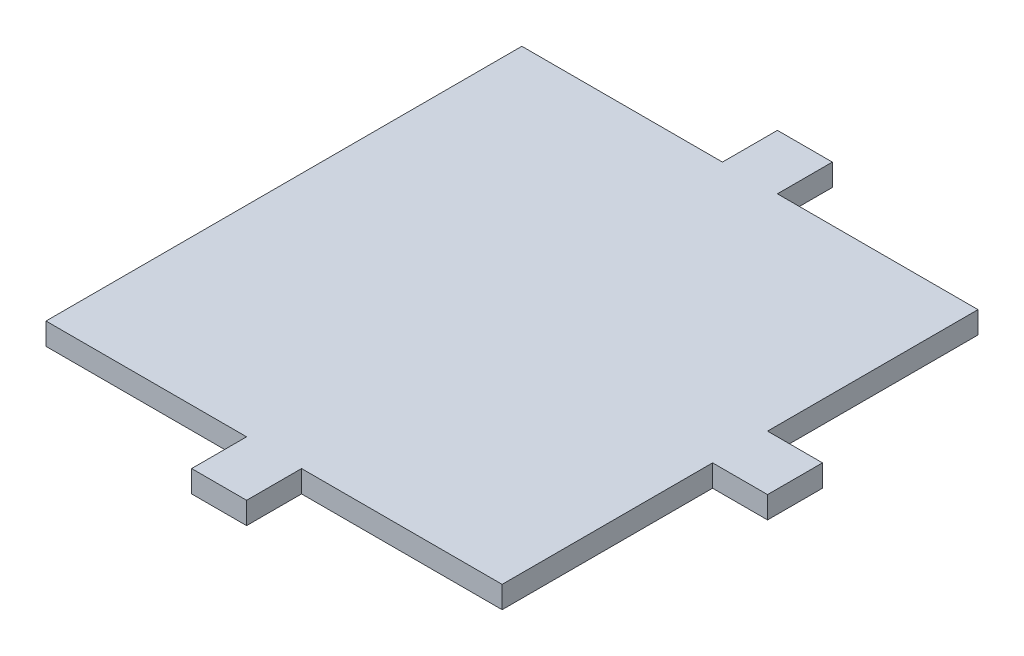
ISO-10303-21;
HEADER;
FILE_DESCRIPTION(('STEP AP214'),'2;1');
FILE_NAME('part.step','',(''),(''),'','','');
FILE_SCHEMA(('AUTOMOTIVE_DESIGN { 1 0 10303 214 1 1 1 1 }'));
ENDSEC;
DATA;
#1=APPLICATION_CONTEXT('core data for automotive mechanical design processes');
#2=APPLICATION_PROTOCOL_DEFINITION('international standard','automotive_design',2000,#1);
#3=PRODUCT_CONTEXT('',#1,'mechanical');
#4=PRODUCT('Part','Part','',(#3));
#5=PRODUCT_RELATED_PRODUCT_CATEGORY('part','',(#4));
#6=PRODUCT_DEFINITION_FORMATION('','',#4);
#7=PRODUCT_DEFINITION_CONTEXT('part definition',#1,'design');
#8=PRODUCT_DEFINITION('design','',#6,#7);
#9=PRODUCT_DEFINITION_SHAPE('','',#8);
#10=(LENGTH_UNIT() NAMED_UNIT(*) SI_UNIT(.MILLI.,.METRE.));
#11=(NAMED_UNIT(*) PLANE_ANGLE_UNIT() SI_UNIT($,.RADIAN.));
#12=(NAMED_UNIT(*) SI_UNIT($,.STERADIAN.) SOLID_ANGLE_UNIT());
#13=UNCERTAINTY_MEASURE_WITH_UNIT(LENGTH_MEASURE(1.E-05),#10,'distance_accuracy_value','');
#14=(GEOMETRIC_REPRESENTATION_CONTEXT(3) GLOBAL_UNCERTAINTY_ASSIGNED_CONTEXT((#13)) GLOBAL_UNIT_ASSIGNED_CONTEXT((#10,
#11,#12)) REPRESENTATION_CONTEXT('',''));
#15=CARTESIAN_POINT('',(0.,0.,0.));
#16=DIRECTION('',(0.,0.,1.));
#17=DIRECTION('',(1.,0.,0.));
#18=AXIS2_PLACEMENT_3D('',#15,#16,#17);
#19=CARTESIAN_POINT('',(3.49999999999998,3.,3.49999999999999));
#20=DIRECTION('',(-1.,0.,0.));
#21=DIRECTION('',(0.,0.,1.));
#22=AXIS2_PLACEMENT_3D('',#19,#20,#21);
#23=PLANE('',#22);
#24=DIRECTION('',(0.,0.,-1.));
#25=VECTOR('',#24,1.);
#26=CARTESIAN_POINT('',(3.49999999999998,0.,3.49999999999999));
#27=LINE('',#26,#25);
#28=CARTESIAN_POINT('',(3.49999999999998,0.,3.49999999999999));
#29=VERTEX_POINT('',#28);
#30=CARTESIAN_POINT('',(3.49999999999998,0.,-3.50000000000001));
#31=VERTEX_POINT('',#30);
#32=EDGE_CURVE('E265',#29,#31,#27,.T.);
#33=ORIENTED_EDGE('',*,*,#32,.T.);
#34=DIRECTION('',(0.,-1.,0.));
#35=VECTOR('',#34,1.);
#36=CARTESIAN_POINT('',(3.49999999999998,3.,-3.50000000000001));
#37=LINE('',#36,#35);
#38=CARTESIAN_POINT('',(3.49999999999998,3.,-3.50000000000001));
#39=VERTEX_POINT('',#38);
#40=EDGE_CURVE('E11',#39,#31,#37,.T.);
#41=ORIENTED_EDGE('',*,*,#40,.F.);
#42=DIRECTION('',(0.,0.,-1.));
#43=VECTOR('',#42,1.);
#44=CARTESIAN_POINT('',(3.49999999999998,3.,3.49999999999999));
#45=LINE('',#44,#43);
#46=CARTESIAN_POINT('',(3.49999999999998,3.,3.49999999999999));
#47=VERTEX_POINT('',#46);
#48=EDGE_CURVE('E266',#47,#39,#45,.T.);
#49=ORIENTED_EDGE('',*,*,#48,.F.);
#50=DIRECTION('',(0.,-1.,0.));
#51=VECTOR('',#50,1.);
#52=CARTESIAN_POINT('',(3.49999999999998,3.,3.49999999999999));
#53=LINE('',#52,#51);
#54=EDGE_CURVE('E276',#47,#29,#53,.T.);
#55=ORIENTED_EDGE('',*,*,#54,.T.);
#56=EDGE_LOOP('',(#33,#41,#49,#55));
#57=FACE_BOUND('',#56,.T.);
#58=ADVANCED_FACE('F33',(#57),#23,.F.);
#59=CARTESIAN_POINT('',(-3.50000000000002,3.,-3.50000000000001));
#60=DIRECTION('',(0.,0.,1.));
#61=DIRECTION('',(1.,0.,0.));
#62=AXIS2_PLACEMENT_3D('',#59,#60,#61);
#63=PLANE('',#62);
#64=DIRECTION('',(-1.,0.,0.));
#65=VECTOR('',#64,1.);
#66=CARTESIAN_POINT('',(-3.50000000000002,0.,-3.50000000000001));
#67=LINE('',#66,#65);
#68=CARTESIAN_POINT('',(-3.50000000000002,0.,-3.50000000000001));
#69=VERTEX_POINT('',#68);
#70=EDGE_CURVE('E279',#31,#69,#67,.T.);
#71=ORIENTED_EDGE('',*,*,#70,.T.);
#72=DIRECTION('',(0.,-1.,0.));
#73=VECTOR('',#72,1.);
#74=CARTESIAN_POINT('',(-3.50000000000002,3.,-3.50000000000001));
#75=LINE('',#74,#73);
#76=CARTESIAN_POINT('',(-3.50000000000002,3.,-3.50000000000001));
#77=VERTEX_POINT('',#76);
#78=EDGE_CURVE('E41',#77,#69,#75,.T.);
#79=ORIENTED_EDGE('',*,*,#78,.F.);
#80=DIRECTION('',(-1.,0.,0.));
#81=VECTOR('',#80,1.);
#82=CARTESIAN_POINT('',(-3.50000000000002,3.,-3.50000000000001));
#83=LINE('',#82,#81);
#84=EDGE_CURVE('E75',#39,#77,#83,.T.);
#85=ORIENTED_EDGE('',*,*,#84,.F.);
#86=ORIENTED_EDGE('',*,*,#40,.T.);
#87=EDGE_LOOP('',(#71,#79,#85,#86));
#88=FACE_BOUND('',#87,.T.);
#89=ADVANCED_FACE('F321',(#88),#63,.F.);
#90=CARTESIAN_POINT('',(-3.50000000000002,3.,3.49999999999999));
#91=DIRECTION('',(1.,0.,0.));
#92=DIRECTION('',(0.,0.,-1.));
#93=AXIS2_PLACEMENT_3D('',#90,#91,#92);
#94=PLANE('',#93);
#95=DIRECTION('',(0.,0.,1.));
#96=VECTOR('',#95,1.);
#97=CARTESIAN_POINT('',(-3.50000000000002,0.,3.49999999999999));
#98=LINE('',#97,#96);
#99=CARTESIAN_POINT('',(-3.50000000000002,0.,3.49999999999999));
#100=VERTEX_POINT('',#99);
#101=EDGE_CURVE('E65',#69,#100,#98,.T.);
#102=ORIENTED_EDGE('',*,*,#101,.T.);
#103=DIRECTION('',(0.,-1.,0.));
#104=VECTOR('',#103,1.);
#105=CARTESIAN_POINT('',(-3.50000000000002,3.,3.49999999999999));
#106=LINE('',#105,#104);
#107=CARTESIAN_POINT('',(-3.50000000000002,3.,3.49999999999999));
#108=VERTEX_POINT('',#107);
#109=EDGE_CURVE('E49',#108,#100,#106,.T.);
#110=ORIENTED_EDGE('',*,*,#109,.F.);
#111=DIRECTION('',(0.,0.,1.));
#112=VECTOR('',#111,1.);
#113=CARTESIAN_POINT('',(-3.50000000000002,3.,3.49999999999999));
#114=LINE('',#113,#112);
#115=EDGE_CURVE('E270',#77,#108,#114,.T.);
#116=ORIENTED_EDGE('',*,*,#115,.F.);
#117=ORIENTED_EDGE('',*,*,#78,.T.);
#118=EDGE_LOOP('',(#102,#110,#116,#117));
#119=FACE_BOUND('',#118,.T.);
#120=ADVANCED_FACE('F284',(#119),#94,.F.);
#121=CARTESIAN_POINT('',(-3.50000000000002,3.,3.49999999999999));
#122=DIRECTION('',(0.,0.,-1.));
#123=DIRECTION('',(-1.,0.,0.));
#124=AXIS2_PLACEMENT_3D('',#121,#122,#123);
#125=PLANE('',#124);
#126=DIRECTION('',(1.,0.,0.));
#127=VECTOR('',#126,1.);
#128=CARTESIAN_POINT('',(-3.50000000000002,0.,3.49999999999999));
#129=LINE('',#128,#127);
#130=EDGE_CURVE('E70',#100,#29,#129,.T.);
#131=ORIENTED_EDGE('',*,*,#130,.T.);
#132=ORIENTED_EDGE('',*,*,#54,.F.);
#133=DIRECTION('',(1.,0.,0.));
#134=VECTOR('',#133,1.);
#135=CARTESIAN_POINT('',(-3.50000000000002,3.,3.49999999999999));
#136=LINE('',#135,#134);
#137=EDGE_CURVE('E273',#108,#47,#136,.T.);
#138=ORIENTED_EDGE('',*,*,#137,.F.);
#139=ORIENTED_EDGE('',*,*,#109,.T.);
#140=EDGE_LOOP('',(#131,#132,#138,#139));
#141=FACE_BOUND('',#140,.T.);
#142=ADVANCED_FACE('F289',(#141),#125,.F.);
#143=CARTESIAN_POINT('',(0.,0.,0.));
#144=DIRECTION('',(0.,-1.,0.));
#145=DIRECTION('',(0.,0.,-1.));
#146=AXIS2_PLACEMENT_3D('',#143,#144,#145);
#147=PLANE('',#146);
#148=ORIENTED_EDGE('',*,*,#32,.F.);
#149=ORIENTED_EDGE('',*,*,#130,.F.);
#150=ORIENTED_EDGE('',*,*,#101,.F.);
#151=ORIENTED_EDGE('',*,*,#70,.F.);
#152=EDGE_LOOP('',(#148,#149,#150,#151));
#153=FACE_BOUND('',#152,.T.);
#154=ADVANCED_FACE('F287',(#153),#147,.T.);
#155=CARTESIAN_POINT('',(5.,18.,5.));
#156=DIRECTION('',(-1.,0.,0.));
#157=DIRECTION('',(0.,0.,1.));
#158=AXIS2_PLACEMENT_3D('',#155,#156,#157);
#159=PLANE('',#158);
#160=DIRECTION('',(0.,0.,-1.));
#161=VECTOR('',#160,1.);
#162=CARTESIAN_POINT('',(5.,3.,5.));
#163=LINE('',#162,#161);
#164=CARTESIAN_POINT('',(5.,3.,5.));
#165=VERTEX_POINT('',#164);
#166=CARTESIAN_POINT('',(5.,3.,-5.));
#167=VERTEX_POINT('',#166);
#168=EDGE_CURVE('E227',#165,#167,#163,.T.);
#169=ORIENTED_EDGE('',*,*,#168,.T.);
#170=DIRECTION('',(0.,-1.,0.));
#171=VECTOR('',#170,1.);
#172=CARTESIAN_POINT('',(5.,18.,-5.));
#173=LINE('',#172,#171);
#174=CARTESIAN_POINT('',(5.,18.,-5.));
#175=VERTEX_POINT('',#174);
#176=EDGE_CURVE('E262',#175,#167,#173,.T.);
#177=ORIENTED_EDGE('',*,*,#176,.F.);
#178=DIRECTION('',(0.,0.,-1.));
#179=VECTOR('',#178,1.);
#180=CARTESIAN_POINT('',(5.,18.,5.));
#181=LINE('',#180,#179);
#182=CARTESIAN_POINT('',(5.,18.,5.));
#183=VERTEX_POINT('',#182);
#184=EDGE_CURVE('E236',#183,#175,#181,.T.);
#185=ORIENTED_EDGE('',*,*,#184,.F.);
#186=DIRECTION('',(0.,-1.,0.));
#187=VECTOR('',#186,1.);
#188=CARTESIAN_POINT('',(5.,18.,5.));
#189=LINE('',#188,#187);
#190=EDGE_CURVE('E248',#183,#165,#189,.T.);
#191=ORIENTED_EDGE('',*,*,#190,.T.);
#192=EDGE_LOOP('',(#169,#177,#185,#191));
#193=FACE_BOUND('',#192,.T.);
#194=ADVANCED_FACE('F302',(#193),#159,.F.);
#195=CARTESIAN_POINT('',(-5.,18.,-5.));
#196=DIRECTION('',(0.,0.,1.));
#197=DIRECTION('',(1.,0.,0.));
#198=AXIS2_PLACEMENT_3D('',#195,#196,#197);
#199=PLANE('',#198);
#200=DIRECTION('',(-1.,0.,0.));
#201=VECTOR('',#200,1.);
#202=CARTESIAN_POINT('',(-5.,3.,-5.));
#203=LINE('',#202,#201);
#204=CARTESIAN_POINT('',(-5.,3.,-5.));
#205=VERTEX_POINT('',#204);
#206=EDGE_CURVE('E230',#167,#205,#203,.T.);
#207=ORIENTED_EDGE('',*,*,#206,.T.);
#208=DIRECTION('',(0.,-1.,0.));
#209=VECTOR('',#208,1.);
#210=CARTESIAN_POINT('',(-5.,18.,-5.));
#211=LINE('',#210,#209);
#212=CARTESIAN_POINT('',(-5.,18.,-5.));
#213=VERTEX_POINT('',#212);
#214=EDGE_CURVE('E259',#213,#205,#211,.T.);
#215=ORIENTED_EDGE('',*,*,#214,.F.);
#216=DIRECTION('',(-1.,0.,0.));
#217=VECTOR('',#216,1.);
#218=CARTESIAN_POINT('',(-5.,18.,-5.));
#219=LINE('',#218,#217);
#220=EDGE_CURVE('E239',#175,#213,#219,.T.);
#221=ORIENTED_EDGE('',*,*,#220,.F.);
#222=ORIENTED_EDGE('',*,*,#176,.T.);
#223=EDGE_LOOP('',(#207,#215,#221,#222));
#224=FACE_BOUND('',#223,.T.);
#225=ADVANCED_FACE('F311',(#224),#199,.F.);
#226=CARTESIAN_POINT('',(-5.,18.,5.));
#227=DIRECTION('',(1.,0.,0.));
#228=DIRECTION('',(0.,0.,-1.));
#229=AXIS2_PLACEMENT_3D('',#226,#227,#228);
#230=PLANE('',#229);
#231=DIRECTION('',(0.,0.,1.));
#232=VECTOR('',#231,1.);
#233=CARTESIAN_POINT('',(-5.,3.,5.));
#234=LINE('',#233,#232);
#235=CARTESIAN_POINT('',(-5.,3.,5.));
#236=VERTEX_POINT('',#235);
#237=EDGE_CURVE('E251',#205,#236,#234,.T.);
#238=ORIENTED_EDGE('',*,*,#237,.T.);
#239=DIRECTION('',(0.,-1.,0.));
#240=VECTOR('',#239,1.);
#241=CARTESIAN_POINT('',(-5.,18.,5.));
#242=LINE('',#241,#240);
#243=CARTESIAN_POINT('',(-5.,18.,5.));
#244=VERTEX_POINT('',#243);
#245=EDGE_CURVE('E256',#244,#236,#242,.T.);
#246=ORIENTED_EDGE('',*,*,#245,.F.);
#247=DIRECTION('',(0.,0.,1.));
#248=VECTOR('',#247,1.);
#249=CARTESIAN_POINT('',(-5.,18.,5.));
#250=LINE('',#249,#248);
#251=EDGE_CURVE('E243',#213,#244,#250,.T.);
#252=ORIENTED_EDGE('',*,*,#251,.F.);
#253=ORIENTED_EDGE('',*,*,#214,.T.);
#254=EDGE_LOOP('',(#238,#246,#252,#253));
#255=FACE_BOUND('',#254,.T.);
#256=ADVANCED_FACE('F309',(#255),#230,.F.);
#257=CARTESIAN_POINT('',(-5.,18.,5.));
#258=DIRECTION('',(0.,0.,-1.));
#259=DIRECTION('',(-1.,0.,0.));
#260=AXIS2_PLACEMENT_3D('',#257,#258,#259);
#261=PLANE('',#260);
#262=DIRECTION('',(1.,0.,0.));
#263=VECTOR('',#262,1.);
#264=CARTESIAN_POINT('',(-5.,3.,5.));
#265=LINE('',#264,#263);
#266=EDGE_CURVE('E240',#236,#165,#265,.T.);
#267=ORIENTED_EDGE('',*,*,#266,.T.);
#268=ORIENTED_EDGE('',*,*,#190,.F.);
#269=DIRECTION('',(1.,0.,0.));
#270=VECTOR('',#269,1.);
#271=CARTESIAN_POINT('',(-5.,18.,5.));
#272=LINE('',#271,#270);
#273=EDGE_CURVE('E246',#244,#183,#272,.T.);
#274=ORIENTED_EDGE('',*,*,#273,.F.);
#275=ORIENTED_EDGE('',*,*,#245,.T.);
#276=EDGE_LOOP('',(#267,#268,#274,#275));
#277=FACE_BOUND('',#276,.T.);
#278=ADVANCED_FACE('F295',(#277),#261,.F.);
#279=CARTESIAN_POINT('',(0.,3.,0.));
#280=DIRECTION('',(0.,-1.,0.));
#281=DIRECTION('',(0.,0.,-1.));
#282=AXIS2_PLACEMENT_3D('',#279,#280,#281);
#283=PLANE('',#282);
#284=ORIENTED_EDGE('',*,*,#137,.T.);
#285=ORIENTED_EDGE('',*,*,#48,.T.);
#286=ORIENTED_EDGE('',*,*,#84,.T.);
#287=ORIENTED_EDGE('',*,*,#115,.T.);
#288=EDGE_LOOP('',(#284,#285,#286,#287));
#289=FACE_BOUND('',#288,.T.);
#290=ORIENTED_EDGE('',*,*,#168,.F.);
#291=ORIENTED_EDGE('',*,*,#266,.F.);
#292=ORIENTED_EDGE('',*,*,#237,.F.);
#293=ORIENTED_EDGE('',*,*,#206,.F.);
#294=EDGE_LOOP('',(#290,#291,#292,#293));
#295=FACE_BOUND('',#294,.T.);
#296=ADVANCED_FACE('F291',(#289,#295),#283,.T.);
#297=CARTESIAN_POINT('',(0.,18.,0.));
#298=DIRECTION('',(0.,1.,0.));
#299=DIRECTION('',(0.,0.,1.));
#300=AXIS2_PLACEMENT_3D('',#297,#298,#299);
#301=PLANE('',#300);
#302=DIRECTION('',(1.,0.,0.));
#303=VECTOR('',#302,1.);
#304=CARTESIAN_POINT('',(0.857439738076737,18.,43.2944735512046));
#305=LINE('',#304,#303);
#306=CARTESIAN_POINT('',(-35.6425602619233,18.,43.2944735512046));
#307=VERTEX_POINT('',#306);
#308=CARTESIAN_POINT('',(0.857439738076737,18.,43.2944735512046));
#309=VERTEX_POINT('',#308);
#310=EDGE_CURVE('E226',#307,#309,#305,.T.);
#311=ORIENTED_EDGE('',*,*,#310,.F.);
#312=DIRECTION('',(0.,0.,1.));
#313=VECTOR('',#312,1.);
#314=CARTESIAN_POINT('',(-35.6425602619233,18.,-43.2944735512046));
#315=LINE('',#314,#313);
#316=CARTESIAN_POINT('',(-35.6425602619233,18.,-43.2944735512046));
#317=VERTEX_POINT('',#316);
#318=EDGE_CURVE('E222',#317,#307,#315,.T.);
#319=ORIENTED_EDGE('',*,*,#318,.F.);
#320=DIRECTION('',(-1.,0.,0.));
#321=VECTOR('',#320,1.);
#322=CARTESIAN_POINT('',(0.857439738076738,18.,-43.2944735512046));
#323=LINE('',#322,#321);
#324=CARTESIAN_POINT('',(0.857439738076738,18.,-43.2944735512046));
#325=VERTEX_POINT('',#324);
#326=EDGE_CURVE('E545',#325,#317,#323,.T.);
#327=ORIENTED_EDGE('',*,*,#326,.F.);
#328=DIRECTION('',(0.,0.,1.));
#329=VECTOR('',#328,1.);
#330=CARTESIAN_POINT('',(0.857439738076737,18.,-53.2944735512046));
#331=LINE('',#330,#329);
#332=CARTESIAN_POINT('',(0.857439738076737,18.,-53.2944735512046));
#333=VERTEX_POINT('',#332);
#334=EDGE_CURVE('E577',#333,#325,#331,.T.);
#335=ORIENTED_EDGE('',*,*,#334,.F.);
#336=DIRECTION('',(-1.,0.,0.));
#337=VECTOR('',#336,1.);
#338=CARTESIAN_POINT('',(10.8574397380767,18.,-53.2944735512046));
#339=LINE('',#338,#337);
#340=CARTESIAN_POINT('',(10.8574397380767,18.,-53.2944735512046));
#341=VERTEX_POINT('',#340);
#342=EDGE_CURVE('E575',#341,#333,#339,.T.);
#343=ORIENTED_EDGE('',*,*,#342,.F.);
#344=DIRECTION('',(0.,0.,-1.));
#345=VECTOR('',#344,1.);
#346=CARTESIAN_POINT('',(10.8574397380767,18.,-43.2944735512046));
#347=LINE('',#346,#345);
#348=CARTESIAN_POINT('',(10.8574397380767,18.,-43.2944735512046));
#349=VERTEX_POINT('',#348);
#350=EDGE_CURVE('E573',#349,#341,#347,.T.);
#351=ORIENTED_EDGE('',*,*,#350,.F.);
#352=DIRECTION('',(-1.,0.,0.));
#353=VECTOR('',#352,1.);
#354=CARTESIAN_POINT('',(47.3574397380767,18.,-43.2944735512046));
#355=LINE('',#354,#353);
#356=CARTESIAN_POINT('',(47.3574397380767,18.,-43.2944735512046));
#357=VERTEX_POINT('',#356);
#358=EDGE_CURVE('E571',#357,#349,#355,.T.);
#359=ORIENTED_EDGE('',*,*,#358,.F.);
#360=DIRECTION('',(0.,0.,-1.));
#361=VECTOR('',#360,1.);
#362=CARTESIAN_POINT('',(47.3574397380767,18.,-5.));
#363=LINE('',#362,#361);
#364=CARTESIAN_POINT('',(47.3574397380767,18.,-5.));
#365=VERTEX_POINT('',#364);
#366=EDGE_CURVE('E569',#365,#357,#363,.T.);
#367=ORIENTED_EDGE('',*,*,#366,.F.);
#368=DIRECTION('',(-1.,0.,0.));
#369=VECTOR('',#368,1.);
#370=CARTESIAN_POINT('',(47.3574397380767,18.,-5.));
#371=LINE('',#370,#369);
#372=CARTESIAN_POINT('',(57.3574397380767,18.,-5.));
#373=VERTEX_POINT('',#372);
#374=EDGE_CURVE('E567',#373,#365,#371,.T.);
#375=ORIENTED_EDGE('',*,*,#374,.F.);
#376=DIRECTION('',(0.,0.,-1.));
#377=VECTOR('',#376,1.);
#378=CARTESIAN_POINT('',(57.3574397380767,18.,-5.));
#379=LINE('',#378,#377);
#380=CARTESIAN_POINT('',(57.3574397380767,18.,5.));
#381=VERTEX_POINT('',#380);
#382=EDGE_CURVE('E565',#381,#373,#379,.T.);
#383=ORIENTED_EDGE('',*,*,#382,.F.);
#384=DIRECTION('',(1.,0.,0.));
#385=VECTOR('',#384,1.);
#386=CARTESIAN_POINT('',(47.3574397380767,18.,5.));
#387=LINE('',#386,#385);
#388=CARTESIAN_POINT('',(47.3574397380767,18.,5.));
#389=VERTEX_POINT('',#388);
#390=EDGE_CURVE('E563',#389,#381,#387,.T.);
#391=ORIENTED_EDGE('',*,*,#390,.F.);
#392=DIRECTION('',(0.,0.,-1.));
#393=VECTOR('',#392,1.);
#394=CARTESIAN_POINT('',(47.3574397380767,18.,5.));
#395=LINE('',#394,#393);
#396=CARTESIAN_POINT('',(47.3574397380767,18.,43.2944735512046));
#397=VERTEX_POINT('',#396);
#398=EDGE_CURVE('E561',#397,#389,#395,.T.);
#399=ORIENTED_EDGE('',*,*,#398,.F.);
#400=DIRECTION('',(1.,0.,0.));
#401=VECTOR('',#400,1.);
#402=CARTESIAN_POINT('',(47.3574397380767,18.,43.2944735512046));
#403=LINE('',#402,#401);
#404=CARTESIAN_POINT('',(10.8574397380767,18.,43.2944735512046));
#405=VERTEX_POINT('',#404);
#406=EDGE_CURVE('E559',#405,#397,#403,.T.);
#407=ORIENTED_EDGE('',*,*,#406,.F.);
#408=DIRECTION('',(0.,0.,-1.));
#409=VECTOR('',#408,1.);
#410=CARTESIAN_POINT('',(10.8574397380767,18.,43.2944735512046));
#411=LINE('',#410,#409);
#412=CARTESIAN_POINT('',(10.8574397380767,18.,53.2944735512046));
#413=VERTEX_POINT('',#412);
#414=EDGE_CURVE('E557',#413,#405,#411,.T.);
#415=ORIENTED_EDGE('',*,*,#414,.F.);
#416=DIRECTION('',(1.,0.,0.));
#417=VECTOR('',#416,1.);
#418=CARTESIAN_POINT('',(0.857439738076735,18.,53.2944735512046));
#419=LINE('',#418,#417);
#420=CARTESIAN_POINT('',(0.857439738076735,18.,53.2944735512046));
#421=VERTEX_POINT('',#420);
#422=EDGE_CURVE('E551',#421,#413,#419,.T.);
#423=ORIENTED_EDGE('',*,*,#422,.F.);
#424=DIRECTION('',(0.,0.,1.));
#425=VECTOR('',#424,1.);
#426=CARTESIAN_POINT('',(0.857439738076737,18.,43.2944735512046));
#427=LINE('',#426,#425);
#428=EDGE_CURVE('E549',#309,#421,#427,.T.);
#429=ORIENTED_EDGE('',*,*,#428,.F.);
#430=EDGE_LOOP('',(#311,#319,#327,#335,#343,#351,#359,#367,#375,#383,#391,#399,#407,#415,#423,#429));
#431=FACE_BOUND('',#430,.T.);
#432=ORIENTED_EDGE('',*,*,#273,.T.);
#433=ORIENTED_EDGE('',*,*,#184,.T.);
#434=ORIENTED_EDGE('',*,*,#220,.T.);
#435=ORIENTED_EDGE('',*,*,#251,.T.);
#436=EDGE_LOOP('',(#432,#433,#434,#435));
#437=FACE_BOUND('',#436,.T.);
#438=ADVANCED_FACE('F294',(#431,#437),#301,.F.);
#439=CARTESIAN_POINT('',(0.857439738076737,22.,43.2944735512046));
#440=DIRECTION('',(0.,0.,-1.));
#441=DIRECTION('',(-1.,0.,0.));
#442=AXIS2_PLACEMENT_3D('',#439,#440,#441);
#443=PLANE('',#442);
#444=ORIENTED_EDGE('',*,*,#310,.T.);
#445=DIRECTION('',(0.,-1.,0.));
#446=VECTOR('',#445,1.);
#447=CARTESIAN_POINT('',(0.857439738076737,22.,43.2944735512046));
#448=LINE('',#447,#446);
#449=CARTESIAN_POINT('',(0.857439738076737,22.,43.2944735512046));
#450=VERTEX_POINT('',#449);
#451=EDGE_CURVE('E206',#450,#309,#448,.T.);
#452=ORIENTED_EDGE('',*,*,#451,.F.);
#453=DIRECTION('',(1.,0.,0.));
#454=VECTOR('',#453,1.);
#455=CARTESIAN_POINT('',(0.857439738076737,22.,43.2944735512046));
#456=LINE('',#455,#454);
#457=CARTESIAN_POINT('',(-35.6425602619233,22.,43.2944735512046));
#458=VERTEX_POINT('',#457);
#459=EDGE_CURVE('E213',#458,#450,#456,.T.);
#460=ORIENTED_EDGE('',*,*,#459,.F.);
#461=DIRECTION('',(0.,-1.,0.));
#462=VECTOR('',#461,1.);
#463=CARTESIAN_POINT('',(-35.6425602619233,22.,43.2944735512046));
#464=LINE('',#463,#462);
#465=EDGE_CURVE('E541',#458,#307,#464,.T.);
#466=ORIENTED_EDGE('',*,*,#465,.T.);
#467=EDGE_LOOP('',(#444,#452,#460,#466));
#468=FACE_BOUND('',#467,.T.);
#469=ADVANCED_FACE('F224',(#468),#443,.F.);
#470=CARTESIAN_POINT('',(0.857439738076737,22.,43.2944735512046));
#471=DIRECTION('',(1.,0.,0.));
#472=DIRECTION('',(0.,0.,-1.));
#473=AXIS2_PLACEMENT_3D('',#470,#471,#472);
#474=PLANE('',#473);
#475=ORIENTED_EDGE('',*,*,#428,.T.);
#476=DIRECTION('',(0.,-1.,0.));
#477=VECTOR('',#476,1.);
#478=CARTESIAN_POINT('',(0.857439738076735,22.,53.2944735512046));
#479=LINE('',#478,#477);
#480=CARTESIAN_POINT('',(0.857439738076735,22.,53.2944735512046));
#481=VERTEX_POINT('',#480);
#482=EDGE_CURVE('E209',#481,#421,#479,.T.);
#483=ORIENTED_EDGE('',*,*,#482,.F.);
#484=DIRECTION('',(0.,0.,1.));
#485=VECTOR('',#484,1.);
#486=CARTESIAN_POINT('',(0.857439738076737,22.,43.2944735512046));
#487=LINE('',#486,#485);
#488=EDGE_CURVE('E202',#450,#481,#487,.T.);
#489=ORIENTED_EDGE('',*,*,#488,.F.);
#490=ORIENTED_EDGE('',*,*,#451,.T.);
#491=EDGE_LOOP('',(#475,#483,#489,#490));
#492=FACE_BOUND('',#491,.T.);
#493=ADVANCED_FACE('F204',(#492),#474,.F.);
#494=CARTESIAN_POINT('',(0.857439738076735,22.,53.2944735512046));
#495=DIRECTION('',(0.,0.,-1.));
#496=DIRECTION('',(-1.,0.,0.));
#497=AXIS2_PLACEMENT_3D('',#494,#495,#496);
#498=PLANE('',#497);
#499=ORIENTED_EDGE('',*,*,#422,.T.);
#500=DIRECTION('',(0.,-1.,0.));
#501=VECTOR('',#500,1.);
#502=CARTESIAN_POINT('',(10.8574397380767,22.,53.2944735512046));
#503=LINE('',#502,#501);
#504=CARTESIAN_POINT('',(10.8574397380767,22.,53.2944735512046));
#505=VERTEX_POINT('',#504);
#506=EDGE_CURVE('E232',#505,#413,#503,.T.);
#507=ORIENTED_EDGE('',*,*,#506,.F.);
#508=DIRECTION('',(1.,0.,0.));
#509=VECTOR('',#508,1.);
#510=CARTESIAN_POINT('',(0.857439738076735,22.,53.2944735512046));
#511=LINE('',#510,#509);
#512=EDGE_CURVE('E212',#481,#505,#511,.T.);
#513=ORIENTED_EDGE('',*,*,#512,.F.);
#514=ORIENTED_EDGE('',*,*,#482,.T.);
#515=EDGE_LOOP('',(#499,#507,#513,#514));
#516=FACE_BOUND('',#515,.T.);
#517=ADVANCED_FACE('F388',(#516),#498,.F.);
#518=CARTESIAN_POINT('',(10.8574397380767,22.,43.2944735512046));
#519=DIRECTION('',(-1.,0.,0.));
#520=DIRECTION('',(0.,0.,1.));
#521=AXIS2_PLACEMENT_3D('',#518,#519,#520);
#522=PLANE('',#521);
#523=ORIENTED_EDGE('',*,*,#414,.T.);
#524=DIRECTION('',(0.,-1.,0.));
#525=VECTOR('',#524,1.);
#526=CARTESIAN_POINT('',(10.8574397380767,22.,43.2944735512046));
#527=LINE('',#526,#525);
#528=CARTESIAN_POINT('',(10.8574397380767,22.,43.2944735512046));
#529=VERTEX_POINT('',#528);
#530=EDGE_CURVE('E611',#529,#405,#527,.T.);
#531=ORIENTED_EDGE('',*,*,#530,.F.);
#532=DIRECTION('',(0.,0.,-1.));
#533=VECTOR('',#532,1.);
#534=CARTESIAN_POINT('',(10.8574397380767,22.,43.2944735512046));
#535=LINE('',#534,#533);
#536=EDGE_CURVE('E618',#505,#529,#535,.T.);
#537=ORIENTED_EDGE('',*,*,#536,.F.);
#538=ORIENTED_EDGE('',*,*,#506,.T.);
#539=EDGE_LOOP('',(#523,#531,#537,#538));
#540=FACE_BOUND('',#539,.T.);
#541=ADVANCED_FACE('F397',(#540),#522,.F.);
#542=CARTESIAN_POINT('',(47.3574397380767,22.,43.2944735512046));
#543=DIRECTION('',(0.,0.,-1.));
#544=DIRECTION('',(-1.,0.,0.));
#545=AXIS2_PLACEMENT_3D('',#542,#543,#544);
#546=PLANE('',#545);
#547=ORIENTED_EDGE('',*,*,#406,.T.);
#548=DIRECTION('',(0.,-1.,0.));
#549=VECTOR('',#548,1.);
#550=CARTESIAN_POINT('',(47.3574397380767,22.,43.2944735512046));
#551=LINE('',#550,#549);
#552=CARTESIAN_POINT('',(47.3574397380767,22.,43.2944735512046));
#553=VERTEX_POINT('',#552);
#554=EDGE_CURVE('E608',#553,#397,#551,.T.);
#555=ORIENTED_EDGE('',*,*,#554,.F.);
#556=DIRECTION('',(1.,0.,0.));
#557=VECTOR('',#556,1.);
#558=CARTESIAN_POINT('',(47.3574397380767,22.,43.2944735512046));
#559=LINE('',#558,#557);
#560=EDGE_CURVE('E629',#529,#553,#559,.T.);
#561=ORIENTED_EDGE('',*,*,#560,.F.);
#562=ORIENTED_EDGE('',*,*,#530,.T.);
#563=EDGE_LOOP('',(#547,#555,#561,#562));
#564=FACE_BOUND('',#563,.T.);
#565=ADVANCED_FACE('F407',(#564),#546,.F.);
#566=CARTESIAN_POINT('',(47.3574397380767,22.,5.));
#567=DIRECTION('',(-1.,0.,0.));
#568=DIRECTION('',(0.,0.,1.));
#569=AXIS2_PLACEMENT_3D('',#566,#567,#568);
#570=PLANE('',#569);
#571=ORIENTED_EDGE('',*,*,#398,.T.);
#572=DIRECTION('',(0.,-1.,0.));
#573=VECTOR('',#572,1.);
#574=CARTESIAN_POINT('',(47.3574397380767,22.,5.));
#575=LINE('',#574,#573);
#576=CARTESIAN_POINT('',(47.3574397380767,22.,5.));
#577=VERTEX_POINT('',#576);
#578=EDGE_CURVE('E605',#577,#389,#575,.T.);
#579=ORIENTED_EDGE('',*,*,#578,.F.);
#580=DIRECTION('',(0.,0.,-1.));
#581=VECTOR('',#580,1.);
#582=CARTESIAN_POINT('',(47.3574397380767,22.,5.));
#583=LINE('',#582,#581);
#584=EDGE_CURVE('E626',#553,#577,#583,.T.);
#585=ORIENTED_EDGE('',*,*,#584,.F.);
#586=ORIENTED_EDGE('',*,*,#554,.T.);
#587=EDGE_LOOP('',(#571,#579,#585,#586));
#588=FACE_BOUND('',#587,.T.);
#589=ADVANCED_FACE('F417',(#588),#570,.F.);
#590=CARTESIAN_POINT('',(47.3574397380767,22.,5.));
#591=DIRECTION('',(0.,0.,-1.));
#592=DIRECTION('',(-1.,0.,0.));
#593=AXIS2_PLACEMENT_3D('',#590,#591,#592);
#594=PLANE('',#593);
#595=ORIENTED_EDGE('',*,*,#390,.T.);
#596=DIRECTION('',(0.,-1.,0.));
#597=VECTOR('',#596,1.);
#598=CARTESIAN_POINT('',(57.3574397380767,22.,5.));
#599=LINE('',#598,#597);
#600=CARTESIAN_POINT('',(57.3574397380767,22.,5.));
#601=VERTEX_POINT('',#600);
#602=EDGE_CURVE('E602',#601,#381,#599,.T.);
#603=ORIENTED_EDGE('',*,*,#602,.F.);
#604=DIRECTION('',(1.,0.,0.));
#605=VECTOR('',#604,1.);
#606=CARTESIAN_POINT('',(47.3574397380767,22.,5.));
#607=LINE('',#606,#605);
#608=EDGE_CURVE('E628',#577,#601,#607,.T.);
#609=ORIENTED_EDGE('',*,*,#608,.F.);
#610=ORIENTED_EDGE('',*,*,#578,.T.);
#611=EDGE_LOOP('',(#595,#603,#609,#610));
#612=FACE_BOUND('',#611,.T.);
#613=ADVANCED_FACE('F427',(#612),#594,.F.);
#614=CARTESIAN_POINT('',(57.3574397380767,22.,-5.));
#615=DIRECTION('',(-1.,0.,0.));
#616=DIRECTION('',(0.,0.,1.));
#617=AXIS2_PLACEMENT_3D('',#614,#615,#616);
#618=PLANE('',#617);
#619=ORIENTED_EDGE('',*,*,#382,.T.);
#620=DIRECTION('',(0.,-1.,0.));
#621=VECTOR('',#620,1.);
#622=CARTESIAN_POINT('',(57.3574397380767,22.,-5.));
#623=LINE('',#622,#621);
#624=CARTESIAN_POINT('',(57.3574397380767,22.,-5.));
#625=VERTEX_POINT('',#624);
#626=EDGE_CURVE('E599',#625,#373,#623,.T.);
#627=ORIENTED_EDGE('',*,*,#626,.F.);
#628=DIRECTION('',(0.,0.,-1.));
#629=VECTOR('',#628,1.);
#630=CARTESIAN_POINT('',(57.3574397380767,22.,-5.));
#631=LINE('',#630,#629);
#632=EDGE_CURVE('E631',#601,#625,#631,.T.);
#633=ORIENTED_EDGE('',*,*,#632,.F.);
#634=ORIENTED_EDGE('',*,*,#602,.T.);
#635=EDGE_LOOP('',(#619,#627,#633,#634));
#636=FACE_BOUND('',#635,.T.);
#637=ADVANCED_FACE('F437',(#636),#618,.F.);
#638=CARTESIAN_POINT('',(47.3574397380767,22.,-5.));
#639=DIRECTION('',(0.,0.,1.));
#640=DIRECTION('',(1.,0.,0.));
#641=AXIS2_PLACEMENT_3D('',#638,#639,#640);
#642=PLANE('',#641);
#643=ORIENTED_EDGE('',*,*,#374,.T.);
#644=DIRECTION('',(0.,-1.,0.));
#645=VECTOR('',#644,1.);
#646=CARTESIAN_POINT('',(47.3574397380767,22.,-5.));
#647=LINE('',#646,#645);
#648=CARTESIAN_POINT('',(47.3574397380767,22.,-5.));
#649=VERTEX_POINT('',#648);
#650=EDGE_CURVE('E596',#649,#365,#647,.T.);
#651=ORIENTED_EDGE('',*,*,#650,.F.);
#652=DIRECTION('',(-1.,0.,0.));
#653=VECTOR('',#652,1.);
#654=CARTESIAN_POINT('',(47.3574397380767,22.,-5.));
#655=LINE('',#654,#653);
#656=EDGE_CURVE('E637',#625,#649,#655,.T.);
#657=ORIENTED_EDGE('',*,*,#656,.F.);
#658=ORIENTED_EDGE('',*,*,#626,.T.);
#659=EDGE_LOOP('',(#643,#651,#657,#658));
#660=FACE_BOUND('',#659,.T.);
#661=ADVANCED_FACE('F447',(#660),#642,.F.);
#662=CARTESIAN_POINT('',(47.3574397380767,22.,-5.));
#663=DIRECTION('',(-1.,0.,0.));
#664=DIRECTION('',(0.,0.,1.));
#665=AXIS2_PLACEMENT_3D('',#662,#663,#664);
#666=PLANE('',#665);
#667=ORIENTED_EDGE('',*,*,#366,.T.);
#668=DIRECTION('',(0.,-1.,0.));
#669=VECTOR('',#668,1.);
#670=CARTESIAN_POINT('',(47.3574397380767,22.,-43.2944735512046));
#671=LINE('',#670,#669);
#672=CARTESIAN_POINT('',(47.3574397380767,22.,-43.2944735512046));
#673=VERTEX_POINT('',#672);
#674=EDGE_CURVE('E593',#673,#357,#671,.T.);
#675=ORIENTED_EDGE('',*,*,#674,.F.);
#676=DIRECTION('',(0.,0.,-1.));
#677=VECTOR('',#676,1.);
#678=CARTESIAN_POINT('',(47.3574397380767,22.,-5.));
#679=LINE('',#678,#677);
#680=EDGE_CURVE('E639',#649,#673,#679,.T.);
#681=ORIENTED_EDGE('',*,*,#680,.F.);
#682=ORIENTED_EDGE('',*,*,#650,.T.);
#683=EDGE_LOOP('',(#667,#675,#681,#682));
#684=FACE_BOUND('',#683,.T.);
#685=ADVANCED_FACE('F457',(#684),#666,.F.);
#686=CARTESIAN_POINT('',(47.3574397380767,22.,-43.2944735512046));
#687=DIRECTION('',(0.,0.,1.));
#688=DIRECTION('',(1.,0.,0.));
#689=AXIS2_PLACEMENT_3D('',#686,#687,#688);
#690=PLANE('',#689);
#691=ORIENTED_EDGE('',*,*,#358,.T.);
#692=DIRECTION('',(0.,-1.,0.));
#693=VECTOR('',#692,1.);
#694=CARTESIAN_POINT('',(10.8574397380767,22.,-43.2944735512046));
#695=LINE('',#694,#693);
#696=CARTESIAN_POINT('',(10.8574397380767,22.,-43.2944735512046));
#697=VERTEX_POINT('',#696);
#698=EDGE_CURVE('E590',#697,#349,#695,.T.);
#699=ORIENTED_EDGE('',*,*,#698,.F.);
#700=DIRECTION('',(-1.,0.,0.));
#701=VECTOR('',#700,1.);
#702=CARTESIAN_POINT('',(47.3574397380767,22.,-43.2944735512046));
#703=LINE('',#702,#701);
#704=EDGE_CURVE('E641',#673,#697,#703,.T.);
#705=ORIENTED_EDGE('',*,*,#704,.F.);
#706=ORIENTED_EDGE('',*,*,#674,.T.);
#707=EDGE_LOOP('',(#691,#699,#705,#706));
#708=FACE_BOUND('',#707,.T.);
#709=ADVANCED_FACE('F467',(#708),#690,.F.);
#710=CARTESIAN_POINT('',(10.8574397380767,22.,-43.2944735512046));
#711=DIRECTION('',(-1.,0.,0.));
#712=DIRECTION('',(0.,0.,1.));
#713=AXIS2_PLACEMENT_3D('',#710,#711,#712);
#714=PLANE('',#713);
#715=ORIENTED_EDGE('',*,*,#350,.T.);
#716=DIRECTION('',(0.,-1.,0.));
#717=VECTOR('',#716,1.);
#718=CARTESIAN_POINT('',(10.8574397380767,22.,-53.2944735512046));
#719=LINE('',#718,#717);
#720=CARTESIAN_POINT('',(10.8574397380767,22.,-53.2944735512046));
#721=VERTEX_POINT('',#720);
#722=EDGE_CURVE('E587',#721,#341,#719,.T.);
#723=ORIENTED_EDGE('',*,*,#722,.F.);
#724=DIRECTION('',(0.,0.,-1.));
#725=VECTOR('',#724,1.);
#726=CARTESIAN_POINT('',(10.8574397380767,22.,-43.2944735512046));
#727=LINE('',#726,#725);
#728=EDGE_CURVE('E643',#697,#721,#727,.T.);
#729=ORIENTED_EDGE('',*,*,#728,.F.);
#730=ORIENTED_EDGE('',*,*,#698,.T.);
#731=EDGE_LOOP('',(#715,#723,#729,#730));
#732=FACE_BOUND('',#731,.T.);
#733=ADVANCED_FACE('F477',(#732),#714,.F.);
#734=CARTESIAN_POINT('',(10.8574397380767,22.,-53.2944735512046));
#735=DIRECTION('',(0.,0.,1.));
#736=DIRECTION('',(1.,0.,0.));
#737=AXIS2_PLACEMENT_3D('',#734,#735,#736);
#738=PLANE('',#737);
#739=ORIENTED_EDGE('',*,*,#342,.T.);
#740=DIRECTION('',(0.,-1.,0.));
#741=VECTOR('',#740,1.);
#742=CARTESIAN_POINT('',(0.857439738076737,22.,-53.2944735512046));
#743=LINE('',#742,#741);
#744=CARTESIAN_POINT('',(0.857439738076737,22.,-53.2944735512046));
#745=VERTEX_POINT('',#744);
#746=EDGE_CURVE('E584',#745,#333,#743,.T.);
#747=ORIENTED_EDGE('',*,*,#746,.F.);
#748=DIRECTION('',(-1.,0.,0.));
#749=VECTOR('',#748,1.);
#750=CARTESIAN_POINT('',(10.8574397380767,22.,-53.2944735512046));
#751=LINE('',#750,#749);
#752=EDGE_CURVE('E645',#721,#745,#751,.T.);
#753=ORIENTED_EDGE('',*,*,#752,.F.);
#754=ORIENTED_EDGE('',*,*,#722,.T.);
#755=EDGE_LOOP('',(#739,#747,#753,#754));
#756=FACE_BOUND('',#755,.T.);
#757=ADVANCED_FACE('F487',(#756),#738,.F.);
#758=CARTESIAN_POINT('',(0.857439738076737,22.,-53.2944735512046));
#759=DIRECTION('',(1.,0.,0.));
#760=DIRECTION('',(0.,0.,-1.));
#761=AXIS2_PLACEMENT_3D('',#758,#759,#760);
#762=PLANE('',#761);
#763=ORIENTED_EDGE('',*,*,#334,.T.);
#764=DIRECTION('',(0.,-1.,0.));
#765=VECTOR('',#764,1.);
#766=CARTESIAN_POINT('',(0.857439738076738,22.,-43.2944735512046));
#767=LINE('',#766,#765);
#768=CARTESIAN_POINT('',(0.857439738076738,22.,-43.2944735512046));
#769=VERTEX_POINT('',#768);
#770=EDGE_CURVE('E581',#769,#325,#767,.T.);
#771=ORIENTED_EDGE('',*,*,#770,.F.);
#772=DIRECTION('',(0.,0.,1.));
#773=VECTOR('',#772,1.);
#774=CARTESIAN_POINT('',(0.857439738076737,22.,-53.2944735512046));
#775=LINE('',#774,#773);
#776=EDGE_CURVE('E647',#745,#769,#775,.T.);
#777=ORIENTED_EDGE('',*,*,#776,.F.);
#778=ORIENTED_EDGE('',*,*,#746,.T.);
#779=EDGE_LOOP('',(#763,#771,#777,#778));
#780=FACE_BOUND('',#779,.T.);
#781=ADVANCED_FACE('F497',(#780),#762,.F.);
#782=CARTESIAN_POINT('',(0.857439738076738,22.,-43.2944735512046));
#783=DIRECTION('',(0.,0.,1.));
#784=DIRECTION('',(1.,0.,0.));
#785=AXIS2_PLACEMENT_3D('',#782,#783,#784);
#786=PLANE('',#785);
#787=ORIENTED_EDGE('',*,*,#326,.T.);
#788=DIRECTION('',(0.,-1.,0.));
#789=VECTOR('',#788,1.);
#790=CARTESIAN_POINT('',(-35.6425602619233,22.,-43.2944735512046));
#791=LINE('',#790,#789);
#792=CARTESIAN_POINT('',(-35.6425602619233,22.,-43.2944735512046));
#793=VERTEX_POINT('',#792);
#794=EDGE_CURVE('E543',#793,#317,#791,.T.);
#795=ORIENTED_EDGE('',*,*,#794,.F.);
#796=DIRECTION('',(-1.,0.,0.));
#797=VECTOR('',#796,1.);
#798=CARTESIAN_POINT('',(0.857439738076738,22.,-43.2944735512046));
#799=LINE('',#798,#797);
#800=EDGE_CURVE('E648',#769,#793,#799,.T.);
#801=ORIENTED_EDGE('',*,*,#800,.F.);
#802=ORIENTED_EDGE('',*,*,#770,.T.);
#803=EDGE_LOOP('',(#787,#795,#801,#802));
#804=FACE_BOUND('',#803,.T.);
#805=ADVANCED_FACE('F507',(#804),#786,.F.);
#806=CARTESIAN_POINT('',(-35.6425602619233,22.,-43.2944735512046));
#807=DIRECTION('',(1.,0.,0.));
#808=DIRECTION('',(0.,0.,-1.));
#809=AXIS2_PLACEMENT_3D('',#806,#807,#808);
#810=PLANE('',#809);
#811=ORIENTED_EDGE('',*,*,#318,.T.);
#812=ORIENTED_EDGE('',*,*,#465,.F.);
#813=DIRECTION('',(0.,0.,1.));
#814=VECTOR('',#813,1.);
#815=CARTESIAN_POINT('',(-35.6425602619233,22.,-43.2944735512046));
#816=LINE('',#815,#814);
#817=EDGE_CURVE('E218',#793,#458,#816,.T.);
#818=ORIENTED_EDGE('',*,*,#817,.F.);
#819=ORIENTED_EDGE('',*,*,#794,.T.);
#820=EDGE_LOOP('',(#811,#812,#818,#819));
#821=FACE_BOUND('',#820,.T.);
#822=ADVANCED_FACE('F517',(#821),#810,.F.);
#823=CARTESIAN_POINT('',(0.,22.,0.));
#824=DIRECTION('',(0.,1.,0.));
#825=DIRECTION('',(0.,0.,1.));
#826=AXIS2_PLACEMENT_3D('',#823,#824,#825);
#827=PLANE('',#826);
#828=ORIENTED_EDGE('',*,*,#459,.T.);
#829=ORIENTED_EDGE('',*,*,#488,.T.);
#830=ORIENTED_EDGE('',*,*,#512,.T.);
#831=ORIENTED_EDGE('',*,*,#536,.T.);
#832=ORIENTED_EDGE('',*,*,#560,.T.);
#833=ORIENTED_EDGE('',*,*,#584,.T.);
#834=ORIENTED_EDGE('',*,*,#608,.T.);
#835=ORIENTED_EDGE('',*,*,#632,.T.);
#836=ORIENTED_EDGE('',*,*,#656,.T.);
#837=ORIENTED_EDGE('',*,*,#680,.T.);
#838=ORIENTED_EDGE('',*,*,#704,.T.);
#839=ORIENTED_EDGE('',*,*,#728,.T.);
#840=ORIENTED_EDGE('',*,*,#752,.T.);
#841=ORIENTED_EDGE('',*,*,#776,.T.);
#842=ORIENTED_EDGE('',*,*,#800,.T.);
#843=ORIENTED_EDGE('',*,*,#817,.T.);
#844=EDGE_LOOP('',(#828,#829,#830,#831,#832,#833,#834,#835,#836,#837,#838,#839,#840,#841,#842,#843));
#845=FACE_BOUND('',#844,.T.);
#846=ADVANCED_FACE('F216',(#845),#827,.T.);
#847=CLOSED_SHELL('',(#58,#89,#120,#142,#154,#194,#225,#256,#278,#296,#438,#469,#493,#517,#541,
#565,#589,#613,#637,#661,#685,#709,#733,#757,#781,#805,#822,#846));
#848=MANIFOLD_SOLID_BREP('B2',#847);
#849=ADVANCED_BREP_SHAPE_REPRESENTATION('',(#18,#848),#14);
#850=SHAPE_DEFINITION_REPRESENTATION(#9,#849);
ENDSEC;
END-ISO-10303-21;
